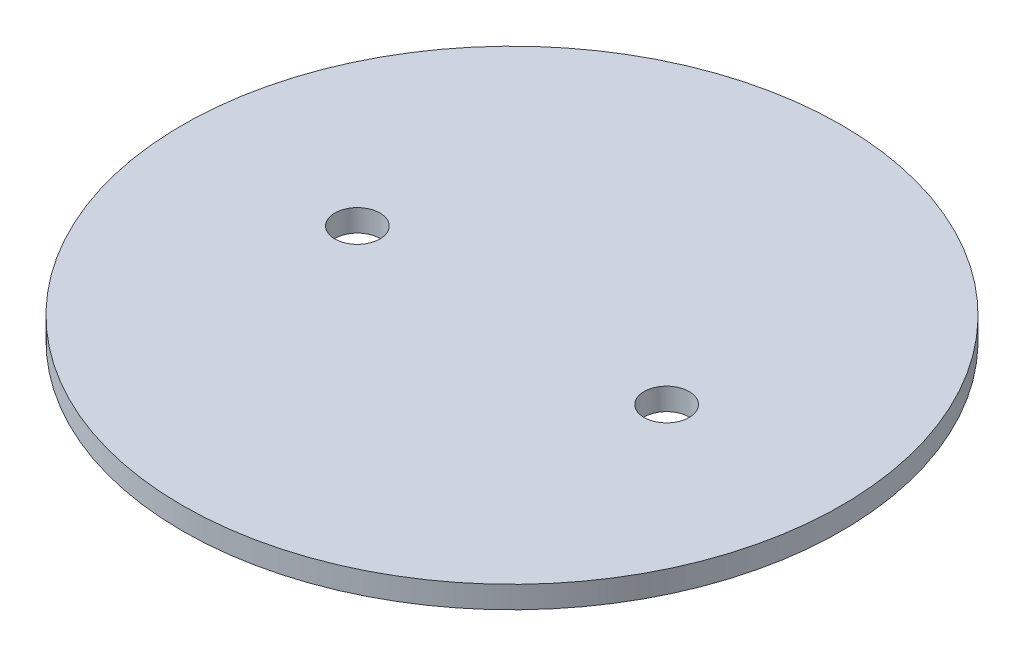
ISO-10303-21;
HEADER;
FILE_DESCRIPTION(('STEP AP214'),'2;1');
FILE_NAME('part.step','',(''),(''),'','','');
FILE_SCHEMA(('AUTOMOTIVE_DESIGN { 1 0 10303 214 1 1 1 1 }'));
ENDSEC;
DATA;
#1=APPLICATION_CONTEXT('core data for automotive mechanical design processes');
#2=APPLICATION_PROTOCOL_DEFINITION('international standard','automotive_design',2000,#1);
#3=PRODUCT_CONTEXT('',#1,'mechanical');
#4=PRODUCT('Part','Part','',(#3));
#5=PRODUCT_RELATED_PRODUCT_CATEGORY('part','',(#4));
#6=PRODUCT_DEFINITION_FORMATION('','',#4);
#7=PRODUCT_DEFINITION_CONTEXT('part definition',#1,'design');
#8=PRODUCT_DEFINITION('design','',#6,#7);
#9=PRODUCT_DEFINITION_SHAPE('','',#8);
#10=(LENGTH_UNIT() NAMED_UNIT(*) SI_UNIT(.MILLI.,.METRE.));
#11=(NAMED_UNIT(*) PLANE_ANGLE_UNIT() SI_UNIT($,.RADIAN.));
#12=(NAMED_UNIT(*) SI_UNIT($,.STERADIAN.) SOLID_ANGLE_UNIT());
#13=UNCERTAINTY_MEASURE_WITH_UNIT(LENGTH_MEASURE(1.E-05),#10,'distance_accuracy_value','');
#14=(GEOMETRIC_REPRESENTATION_CONTEXT(3) GLOBAL_UNCERTAINTY_ASSIGNED_CONTEXT((#13)) GLOBAL_UNIT_ASSIGNED_CONTEXT((#10,
#11,#12)) REPRESENTATION_CONTEXT('',''));
#15=CARTESIAN_POINT('',(0.,0.,0.));
#16=DIRECTION('',(0.,0.,1.));
#17=DIRECTION('',(1.,0.,0.));
#18=AXIS2_PLACEMENT_3D('',#15,#16,#17);
#19=CARTESIAN_POINT('',(0.,3.175,0.));
#20=DIRECTION('',(0.,1.,0.));
#21=DIRECTION('',(0.,0.,1.));
#22=AXIS2_PLACEMENT_3D('',#19,#20,#21);
#23=PLANE('',#22);
#24=CARTESIAN_POINT('',(22.225,3.175,0.));
#25=DIRECTION('',(0.,1.,0.));
#26=DIRECTION('',(0.,0.,1.));
#27=AXIS2_PLACEMENT_3D('',#24,#25,#26);
#28=CIRCLE('',#27,3.2385);
#29=CARTESIAN_POINT('',(22.225,3.175,3.2385));
#30=VERTEX_POINT('',#29);
#31=EDGE_CURVE('E52',#30,#30,#28,.T.);
#32=ORIENTED_EDGE('',*,*,#31,.F.);
#33=EDGE_LOOP('',(#32));
#34=FACE_BOUND('',#33,.T.);
#35=CARTESIAN_POINT('',(0.,3.175,0.));
#36=DIRECTION('',(0.,1.,0.));
#37=DIRECTION('',(0.,0.,1.));
#38=AXIS2_PLACEMENT_3D('',#35,#36,#37);
#39=CIRCLE('',#38,47.371);
#40=CARTESIAN_POINT('',(0.,3.175,47.371));
#41=VERTEX_POINT('',#40);
#42=EDGE_CURVE('E10',#41,#41,#39,.T.);
#43=ORIENTED_EDGE('',*,*,#42,.T.);
#44=EDGE_LOOP('',(#43));
#45=FACE_BOUND('',#44,.T.);
#46=CARTESIAN_POINT('',(-22.225,3.175,0.));
#47=DIRECTION('',(0.,1.,0.));
#48=DIRECTION('',(0.,0.,1.));
#49=AXIS2_PLACEMENT_3D('',#46,#47,#48);
#50=CIRCLE('',#49,3.2385);
#51=CARTESIAN_POINT('',(-22.225,3.175,3.2385));
#52=VERTEX_POINT('',#51);
#53=EDGE_CURVE('E57',#52,#52,#50,.T.);
#54=ORIENTED_EDGE('',*,*,#53,.F.);
#55=EDGE_LOOP('',(#54));
#56=FACE_BOUND('',#55,.T.);
#57=ADVANCED_FACE('F41',(#34,#45,#56),#23,.T.);
#58=CARTESIAN_POINT('',(0.,0.,0.));
#59=DIRECTION('',(0.,1.,0.));
#60=DIRECTION('',(0.,0.,1.));
#61=AXIS2_PLACEMENT_3D('',#58,#59,#60);
#62=PLANE('',#61);
#63=CARTESIAN_POINT('',(0.,0.,0.));
#64=DIRECTION('',(0.,1.,0.));
#65=DIRECTION('',(0.,0.,1.));
#66=AXIS2_PLACEMENT_3D('',#63,#64,#65);
#67=CIRCLE('',#66,47.371);
#68=CARTESIAN_POINT('',(0.,0.,47.371));
#69=VERTEX_POINT('',#68);
#70=EDGE_CURVE('E45',#69,#69,#67,.T.);
#71=ORIENTED_EDGE('',*,*,#70,.F.);
#72=EDGE_LOOP('',(#71));
#73=FACE_BOUND('',#72,.T.);
#74=CARTESIAN_POINT('',(22.225,0.,0.));
#75=DIRECTION('',(0.,1.,0.));
#76=DIRECTION('',(0.,0.,1.));
#77=AXIS2_PLACEMENT_3D('',#74,#75,#76);
#78=CIRCLE('',#77,3.2385);
#79=CARTESIAN_POINT('',(22.225,0.,3.2385));
#80=VERTEX_POINT('',#79);
#81=EDGE_CURVE('E54',#80,#80,#78,.T.);
#82=ORIENTED_EDGE('',*,*,#81,.T.);
#83=EDGE_LOOP('',(#82));
#84=FACE_BOUND('',#83,.T.);
#85=CARTESIAN_POINT('',(-22.225,0.,0.));
#86=DIRECTION('',(0.,1.,0.));
#87=DIRECTION('',(0.,0.,1.));
#88=AXIS2_PLACEMENT_3D('',#85,#86,#87);
#89=CIRCLE('',#88,3.2385);
#90=CARTESIAN_POINT('',(-22.225,0.,3.2385));
#91=VERTEX_POINT('',#90);
#92=EDGE_CURVE('E60',#91,#91,#89,.T.);
#93=ORIENTED_EDGE('',*,*,#92,.T.);
#94=EDGE_LOOP('',(#93));
#95=FACE_BOUND('',#94,.T.);
#96=ADVANCED_FACE('F70',(#73,#84,#95),#62,.F.);
#97=CARTESIAN_POINT('',(0.,3.175,0.));
#98=DIRECTION('',(0.,-1.,0.));
#99=DIRECTION('',(0.,0.,-1.));
#100=AXIS2_PLACEMENT_3D('',#97,#98,#99);
#101=CYLINDRICAL_SURFACE('',#100,47.371);
#102=ORIENTED_EDGE('',*,*,#42,.F.);
#103=EDGE_LOOP('',(#102));
#104=FACE_BOUND('',#103,.T.);
#105=ORIENTED_EDGE('',*,*,#70,.T.);
#106=EDGE_LOOP('',(#105));
#107=FACE_BOUND('',#106,.T.);
#108=ADVANCED_FACE('F43',(#104,#107),#101,.T.);
#109=CARTESIAN_POINT('',(22.225,3.175,0.));
#110=DIRECTION('',(0.,-1.,0.));
#111=DIRECTION('',(0.,0.,-1.));
#112=AXIS2_PLACEMENT_3D('',#109,#110,#111);
#113=CYLINDRICAL_SURFACE('',#112,3.2385);
#114=ORIENTED_EDGE('',*,*,#31,.T.);
#115=EDGE_LOOP('',(#114));
#116=FACE_BOUND('',#115,.T.);
#117=ORIENTED_EDGE('',*,*,#81,.F.);
#118=EDGE_LOOP('',(#117));
#119=FACE_BOUND('',#118,.T.);
#120=ADVANCED_FACE('F79',(#116,#119),#113,.F.);
#121=CARTESIAN_POINT('',(-22.225,3.175,0.));
#122=DIRECTION('',(0.,-1.,0.));
#123=DIRECTION('',(0.,0.,-1.));
#124=AXIS2_PLACEMENT_3D('',#121,#122,#123);
#125=CYLINDRICAL_SURFACE('',#124,3.2385);
#126=ORIENTED_EDGE('',*,*,#53,.T.);
#127=EDGE_LOOP('',(#126));
#128=FACE_BOUND('',#127,.T.);
#129=ORIENTED_EDGE('',*,*,#92,.F.);
#130=EDGE_LOOP('',(#129));
#131=FACE_BOUND('',#130,.T.);
#132=ADVANCED_FACE('F66',(#128,#131),#125,.F.);
#133=CLOSED_SHELL('',(#57,#96,#108,#120,#132));
#134=MANIFOLD_SOLID_BREP('B2',#133);
#135=ADVANCED_BREP_SHAPE_REPRESENTATION('',(#18,#134),#14);
#136=SHAPE_DEFINITION_REPRESENTATION(#9,#135);
ENDSEC;
END-ISO-10303-21;
